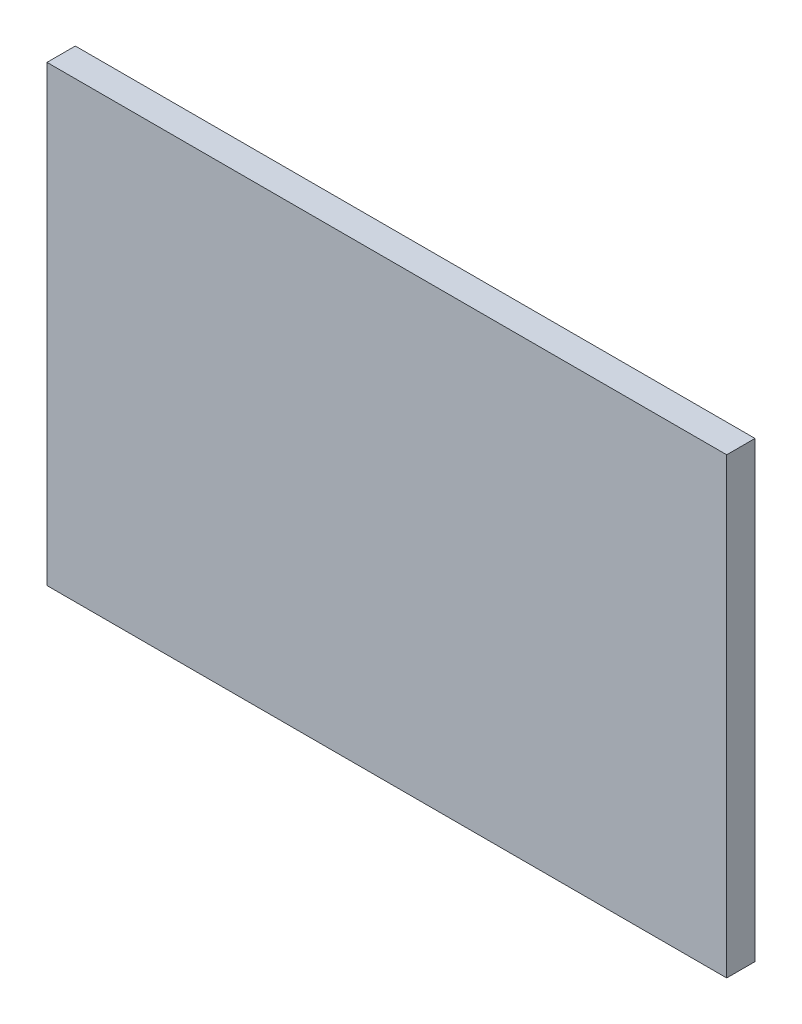
ISO-10303-21;
HEADER;
FILE_DESCRIPTION(('STEP AP214'),'2;1');
FILE_NAME('part.step','',(''),(''),'','','');
FILE_SCHEMA(('AUTOMOTIVE_DESIGN { 1 0 10303 214 1 1 1 1 }'));
ENDSEC;
DATA;
#1=APPLICATION_CONTEXT('core data for automotive mechanical design processes');
#2=APPLICATION_PROTOCOL_DEFINITION('international standard','automotive_design',2000,#1);
#3=PRODUCT_CONTEXT('',#1,'mechanical');
#4=PRODUCT('Part','Part','',(#3));
#5=PRODUCT_RELATED_PRODUCT_CATEGORY('part','',(#4));
#6=PRODUCT_DEFINITION_FORMATION('','',#4);
#7=PRODUCT_DEFINITION_CONTEXT('part definition',#1,'design');
#8=PRODUCT_DEFINITION('design','',#6,#7);
#9=PRODUCT_DEFINITION_SHAPE('','',#8);
#10=(LENGTH_UNIT() NAMED_UNIT(*) SI_UNIT(.MILLI.,.METRE.));
#11=(NAMED_UNIT(*) PLANE_ANGLE_UNIT() SI_UNIT($,.RADIAN.));
#12=(NAMED_UNIT(*) SI_UNIT($,.STERADIAN.) SOLID_ANGLE_UNIT());
#13=UNCERTAINTY_MEASURE_WITH_UNIT(LENGTH_MEASURE(1.E-05),#10,'distance_accuracy_value','');
#14=(GEOMETRIC_REPRESENTATION_CONTEXT(3) GLOBAL_UNCERTAINTY_ASSIGNED_CONTEXT((#13)) GLOBAL_UNIT_ASSIGNED_CONTEXT((#10,
#11,#12)) REPRESENTATION_CONTEXT('',''));
#15=CARTESIAN_POINT('',(0.,0.,0.));
#16=DIRECTION('',(0.,0.,1.));
#17=DIRECTION('',(1.,0.,0.));
#18=AXIS2_PLACEMENT_3D('',#15,#16,#17);
#19=CARTESIAN_POINT('',(0.,0.,0.));
#20=DIRECTION('',(0.,0.,1.));
#21=DIRECTION('',(1.,0.,0.));
#22=AXIS2_PLACEMENT_3D('',#19,#20,#21);
#23=PLANE('',#22);
#24=DIRECTION('',(1.,0.,0.));
#25=VECTOR('',#24,1.);
#26=CARTESIAN_POINT('',(1.2,0.8,0.));
#27=LINE('',#26,#25);
#28=CARTESIAN_POINT('',(1.2,0.8,0.));
#29=VERTEX_POINT('',#28);
#30=CARTESIAN_POINT('',(-1.2,0.8,0.));
#31=VERTEX_POINT('',#30);
#32=EDGE_CURVE('E78',#29,#31,#27,.F.);
#33=ORIENTED_EDGE('',*,*,#32,.F.);
#34=DIRECTION('',(0.,1.,0.));
#35=VECTOR('',#34,1.);
#36=CARTESIAN_POINT('',(1.2,-0.8,0.));
#37=LINE('',#36,#35);
#38=CARTESIAN_POINT('',(1.2,-0.8,0.));
#39=VERTEX_POINT('',#38);
#40=EDGE_CURVE('E54',#39,#29,#37,.T.);
#41=ORIENTED_EDGE('',*,*,#40,.F.);
#42=DIRECTION('',(1.,0.,0.));
#43=VECTOR('',#42,1.);
#44=CARTESIAN_POINT('',(-1.2,-0.8,0.));
#45=LINE('',#44,#43);
#46=CARTESIAN_POINT('',(-1.2,-0.8,0.));
#47=VERTEX_POINT('',#46);
#48=EDGE_CURVE('E56',#47,#39,#45,.T.);
#49=ORIENTED_EDGE('',*,*,#48,.F.);
#50=DIRECTION('',(0.,1.,0.));
#51=VECTOR('',#50,1.);
#52=CARTESIAN_POINT('',(-1.2,0.8,0.));
#53=LINE('',#52,#51);
#54=EDGE_CURVE('E19',#31,#47,#53,.F.);
#55=ORIENTED_EDGE('',*,*,#54,.F.);
#56=EDGE_LOOP('',(#33,#41,#49,#55));
#57=FACE_BOUND('',#56,.T.);
#58=ADVANCED_FACE('F16',(#57),#23,.F.);
#59=CARTESIAN_POINT('',(-1.2,0.8,0.));
#60=DIRECTION('',(-1.,0.,0.));
#61=DIRECTION('',(0.,0.,1.));
#62=AXIS2_PLACEMENT_3D('',#59,#60,#61);
#63=PLANE('',#62);
#64=DIRECTION('',(0.,1.,0.));
#65=VECTOR('',#64,1.);
#66=CARTESIAN_POINT('',(-1.2,0.,0.1));
#67=LINE('',#66,#65);
#68=CARTESIAN_POINT('',(-1.2,0.8,0.1));
#69=VERTEX_POINT('',#68);
#70=CARTESIAN_POINT('',(-1.2,-0.8,0.1));
#71=VERTEX_POINT('',#70);
#72=EDGE_CURVE('E82',#69,#71,#67,.F.);
#73=ORIENTED_EDGE('',*,*,#72,.F.);
#74=DIRECTION('',(0.,0.,1.));
#75=VECTOR('',#74,1.);
#76=CARTESIAN_POINT('',(-1.2,0.8,0.));
#77=LINE('',#76,#75);
#78=EDGE_CURVE('E67',#31,#69,#77,.T.);
#79=ORIENTED_EDGE('',*,*,#78,.F.);
#80=ORIENTED_EDGE('',*,*,#54,.T.);
#81=DIRECTION('',(0.,0.,-1.));
#82=VECTOR('',#81,1.);
#83=CARTESIAN_POINT('',(-1.2,-0.8,0.));
#84=LINE('',#83,#82);
#85=EDGE_CURVE('E62',#71,#47,#84,.T.);
#86=ORIENTED_EDGE('',*,*,#85,.F.);
#87=EDGE_LOOP('',(#73,#79,#80,#86));
#88=FACE_BOUND('',#87,.T.);
#89=ADVANCED_FACE('F64',(#88),#63,.T.);
#90=CARTESIAN_POINT('',(-1.2,-0.8,0.));
#91=DIRECTION('',(0.,-1.,0.));
#92=DIRECTION('',(0.,0.,-1.));
#93=AXIS2_PLACEMENT_3D('',#90,#91,#92);
#94=PLANE('',#93);
#95=DIRECTION('',(1.,0.,0.));
#96=VECTOR('',#95,1.);
#97=CARTESIAN_POINT('',(0.,-0.8,0.1));
#98=LINE('',#97,#96);
#99=CARTESIAN_POINT('',(1.2,-0.8,0.1));
#100=VERTEX_POINT('',#99);
#101=EDGE_CURVE('E71',#71,#100,#98,.T.);
#102=ORIENTED_EDGE('',*,*,#101,.F.);
#103=ORIENTED_EDGE('',*,*,#85,.T.);
#104=ORIENTED_EDGE('',*,*,#48,.T.);
#105=DIRECTION('',(0.,0.,-1.));
#106=VECTOR('',#105,1.);
#107=CARTESIAN_POINT('',(1.2,-0.8,0.));
#108=LINE('',#107,#106);
#109=EDGE_CURVE('E74',#100,#39,#108,.T.);
#110=ORIENTED_EDGE('',*,*,#109,.F.);
#111=EDGE_LOOP('',(#102,#103,#104,#110));
#112=FACE_BOUND('',#111,.T.);
#113=ADVANCED_FACE('F69',(#112),#94,.T.);
#114=CARTESIAN_POINT('',(1.2,-0.8,0.));
#115=DIRECTION('',(1.,0.,0.));
#116=DIRECTION('',(0.,0.,-1.));
#117=AXIS2_PLACEMENT_3D('',#114,#115,#116);
#118=PLANE('',#117);
#119=DIRECTION('',(0.,1.,0.));
#120=VECTOR('',#119,1.);
#121=CARTESIAN_POINT('',(1.2,0.,0.1));
#122=LINE('',#121,#120);
#123=CARTESIAN_POINT('',(1.2,0.8,0.1));
#124=VERTEX_POINT('',#123);
#125=EDGE_CURVE('E25',#100,#124,#122,.T.);
#126=ORIENTED_EDGE('',*,*,#125,.F.);
#127=ORIENTED_EDGE('',*,*,#109,.T.);
#128=ORIENTED_EDGE('',*,*,#40,.T.);
#129=DIRECTION('',(0.,0.,1.));
#130=VECTOR('',#129,1.);
#131=CARTESIAN_POINT('',(1.2,0.8,0.));
#132=LINE('',#131,#130);
#133=EDGE_CURVE('E34',#124,#29,#132,.F.);
#134=ORIENTED_EDGE('',*,*,#133,.F.);
#135=EDGE_LOOP('',(#126,#127,#128,#134));
#136=FACE_BOUND('',#135,.T.);
#137=ADVANCED_FACE('F88',(#136),#118,.T.);
#138=CARTESIAN_POINT('',(1.2,0.8,0.));
#139=DIRECTION('',(0.,1.,0.));
#140=DIRECTION('',(0.,0.,1.));
#141=AXIS2_PLACEMENT_3D('',#138,#139,#140);
#142=PLANE('',#141);
#143=DIRECTION('',(1.,0.,0.));
#144=VECTOR('',#143,1.);
#145=CARTESIAN_POINT('',(0.,0.8,0.1));
#146=LINE('',#145,#144);
#147=EDGE_CURVE('E11',#124,#69,#146,.F.);
#148=ORIENTED_EDGE('',*,*,#147,.F.);
#149=ORIENTED_EDGE('',*,*,#133,.T.);
#150=ORIENTED_EDGE('',*,*,#32,.T.);
#151=ORIENTED_EDGE('',*,*,#78,.T.);
#152=EDGE_LOOP('',(#148,#149,#150,#151));
#153=FACE_BOUND('',#152,.T.);
#154=ADVANCED_FACE('F90',(#153),#142,.T.);
#155=CARTESIAN_POINT('',(0.,0.,0.1));
#156=DIRECTION('',(0.,0.,1.));
#157=DIRECTION('',(1.,0.,0.));
#158=AXIS2_PLACEMENT_3D('',#155,#156,#157);
#159=PLANE('',#158);
#160=ORIENTED_EDGE('',*,*,#125,.T.);
#161=ORIENTED_EDGE('',*,*,#147,.T.);
#162=ORIENTED_EDGE('',*,*,#72,.T.);
#163=ORIENTED_EDGE('',*,*,#101,.T.);
#164=EDGE_LOOP('',(#160,#161,#162,#163));
#165=FACE_BOUND('',#164,.T.);
#166=ADVANCED_FACE('F87',(#165),#159,.T.);
#167=CLOSED_SHELL('',(#58,#89,#113,#137,#154,#166));
#168=MANIFOLD_SOLID_BREP('B1',#167);
#169=ADVANCED_BREP_SHAPE_REPRESENTATION('',(#18,#168),#14);
#170=SHAPE_DEFINITION_REPRESENTATION(#9,#169);
ENDSEC;
END-ISO-10303-21;
